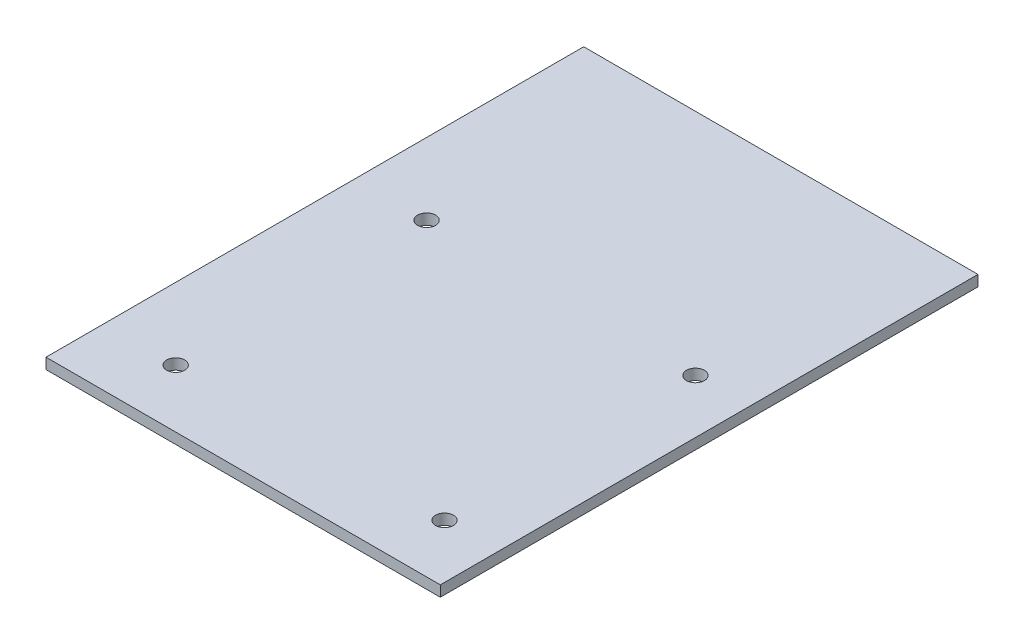
ISO-10303-21;
HEADER;
FILE_DESCRIPTION(('STEP AP214'),'2;1');
FILE_NAME('part.step','',(''),(''),'','','');
FILE_SCHEMA(('AUTOMOTIVE_DESIGN { 1 0 10303 214 1 1 1 1 }'));
ENDSEC;
DATA;
#1=APPLICATION_CONTEXT('core data for automotive mechanical design processes');
#2=APPLICATION_PROTOCOL_DEFINITION('international standard','automotive_design',2000,#1);
#3=PRODUCT_CONTEXT('',#1,'mechanical');
#4=PRODUCT('Part','Part','',(#3));
#5=PRODUCT_RELATED_PRODUCT_CATEGORY('part','',(#4));
#6=PRODUCT_DEFINITION_FORMATION('','',#4);
#7=PRODUCT_DEFINITION_CONTEXT('part definition',#1,'design');
#8=PRODUCT_DEFINITION('design','',#6,#7);
#9=PRODUCT_DEFINITION_SHAPE('','',#8);
#10=(LENGTH_UNIT() NAMED_UNIT(*) SI_UNIT(.MILLI.,.METRE.));
#11=(NAMED_UNIT(*) PLANE_ANGLE_UNIT() SI_UNIT($,.RADIAN.));
#12=(NAMED_UNIT(*) SI_UNIT($,.STERADIAN.) SOLID_ANGLE_UNIT());
#13=UNCERTAINTY_MEASURE_WITH_UNIT(LENGTH_MEASURE(1.E-05),#10,'distance_accuracy_value','');
#14=(GEOMETRIC_REPRESENTATION_CONTEXT(3) GLOBAL_UNCERTAINTY_ASSIGNED_CONTEXT((#13)) GLOBAL_UNIT_ASSIGNED_CONTEXT((#10,
#11,#12)) REPRESENTATION_CONTEXT('',''));
#15=CARTESIAN_POINT('',(0.,0.,0.));
#16=DIRECTION('',(0.,0.,1.));
#17=DIRECTION('',(1.,0.,0.));
#18=AXIS2_PLACEMENT_3D('',#15,#16,#17);
#19=CARTESIAN_POINT('',(-110.,6.,-150.));
#20=DIRECTION('',(1.,0.,0.));
#21=DIRECTION('',(0.,0.,-1.));
#22=AXIS2_PLACEMENT_3D('',#19,#20,#21);
#23=PLANE('',#22);
#24=DIRECTION('',(0.,0.,1.));
#25=VECTOR('',#24,1.);
#26=CARTESIAN_POINT('',(-110.,0.,-150.));
#27=LINE('',#26,#25);
#28=CARTESIAN_POINT('',(-110.,0.,-150.));
#29=VERTEX_POINT('',#28);
#30=CARTESIAN_POINT('',(-110.,0.,150.));
#31=VERTEX_POINT('',#30);
#32=EDGE_CURVE('E93',#29,#31,#27,.T.);
#33=ORIENTED_EDGE('',*,*,#32,.T.);
#34=DIRECTION('',(0.,-1.,0.));
#35=VECTOR('',#34,1.);
#36=CARTESIAN_POINT('',(-110.,6.,150.));
#37=LINE('',#36,#35);
#38=CARTESIAN_POINT('',(-110.,6.,150.));
#39=VERTEX_POINT('',#38);
#40=EDGE_CURVE('E11',#39,#31,#37,.T.);
#41=ORIENTED_EDGE('',*,*,#40,.F.);
#42=DIRECTION('',(0.,0.,1.));
#43=VECTOR('',#42,1.);
#44=CARTESIAN_POINT('',(-110.,6.,-150.));
#45=LINE('',#44,#43);
#46=CARTESIAN_POINT('',(-110.,6.,-150.));
#47=VERTEX_POINT('',#46);
#48=EDGE_CURVE('E81',#47,#39,#45,.T.);
#49=ORIENTED_EDGE('',*,*,#48,.F.);
#50=DIRECTION('',(0.,-1.,0.));
#51=VECTOR('',#50,1.);
#52=CARTESIAN_POINT('',(-110.,6.,-150.));
#53=LINE('',#52,#51);
#54=EDGE_CURVE('E89',#47,#29,#53,.T.);
#55=ORIENTED_EDGE('',*,*,#54,.T.);
#56=EDGE_LOOP('',(#33,#41,#49,#55));
#57=FACE_BOUND('',#56,.T.);
#58=ADVANCED_FACE('F30',(#57),#23,.F.);
#59=CARTESIAN_POINT('',(-110.,6.,150.));
#60=DIRECTION('',(0.,0.,-1.));
#61=DIRECTION('',(-1.,0.,0.));
#62=AXIS2_PLACEMENT_3D('',#59,#60,#61);
#63=PLANE('',#62);
#64=DIRECTION('',(1.,0.,0.));
#65=VECTOR('',#64,1.);
#66=CARTESIAN_POINT('',(-110.,0.,150.));
#67=LINE('',#66,#65);
#68=CARTESIAN_POINT('',(110.,0.,150.));
#69=VERTEX_POINT('',#68);
#70=EDGE_CURVE('E85',#31,#69,#67,.T.);
#71=ORIENTED_EDGE('',*,*,#70,.T.);
#72=DIRECTION('',(0.,-1.,0.));
#73=VECTOR('',#72,1.);
#74=CARTESIAN_POINT('',(110.,6.,150.));
#75=LINE('',#74,#73);
#76=CARTESIAN_POINT('',(110.,6.,150.));
#77=VERTEX_POINT('',#76);
#78=EDGE_CURVE('E38',#77,#69,#75,.T.);
#79=ORIENTED_EDGE('',*,*,#78,.F.);
#80=DIRECTION('',(1.,0.,0.));
#81=VECTOR('',#80,1.);
#82=CARTESIAN_POINT('',(-110.,6.,150.));
#83=LINE('',#82,#81);
#84=EDGE_CURVE('E76',#39,#77,#83,.T.);
#85=ORIENTED_EDGE('',*,*,#84,.F.);
#86=ORIENTED_EDGE('',*,*,#40,.T.);
#87=EDGE_LOOP('',(#71,#79,#85,#86));
#88=FACE_BOUND('',#87,.T.);
#89=ADVANCED_FACE('F84',(#88),#63,.F.);
#90=CARTESIAN_POINT('',(110.,6.,-150.));
#91=DIRECTION('',(-1.,0.,0.));
#92=DIRECTION('',(0.,0.,1.));
#93=AXIS2_PLACEMENT_3D('',#90,#91,#92);
#94=PLANE('',#93);
#95=DIRECTION('',(0.,0.,-1.));
#96=VECTOR('',#95,1.);
#97=CARTESIAN_POINT('',(110.,0.,-150.));
#98=LINE('',#97,#96);
#99=CARTESIAN_POINT('',(110.,0.,-150.));
#100=VERTEX_POINT('',#99);
#101=EDGE_CURVE('E63',#69,#100,#98,.T.);
#102=ORIENTED_EDGE('',*,*,#101,.T.);
#103=DIRECTION('',(0.,-1.,0.));
#104=VECTOR('',#103,1.);
#105=CARTESIAN_POINT('',(110.,6.,-150.));
#106=LINE('',#105,#104);
#107=CARTESIAN_POINT('',(110.,6.,-150.));
#108=VERTEX_POINT('',#107);
#109=EDGE_CURVE('E86',#108,#100,#106,.T.);
#110=ORIENTED_EDGE('',*,*,#109,.F.);
#111=DIRECTION('',(0.,0.,-1.));
#112=VECTOR('',#111,1.);
#113=CARTESIAN_POINT('',(110.,6.,-150.));
#114=LINE('',#113,#112);
#115=EDGE_CURVE('E79',#77,#108,#114,.T.);
#116=ORIENTED_EDGE('',*,*,#115,.F.);
#117=ORIENTED_EDGE('',*,*,#78,.T.);
#118=EDGE_LOOP('',(#102,#110,#116,#117));
#119=FACE_BOUND('',#118,.T.);
#120=ADVANCED_FACE('F87',(#119),#94,.F.);
#121=CARTESIAN_POINT('',(-110.,6.,-150.));
#122=DIRECTION('',(0.,0.,1.));
#123=DIRECTION('',(1.,0.,0.));
#124=AXIS2_PLACEMENT_3D('',#121,#122,#123);
#125=PLANE('',#124);
#126=DIRECTION('',(-1.,0.,0.));
#127=VECTOR('',#126,1.);
#128=CARTESIAN_POINT('',(-110.,0.,-150.));
#129=LINE('',#128,#127);
#130=EDGE_CURVE('E69',#100,#29,#129,.T.);
#131=ORIENTED_EDGE('',*,*,#130,.T.);
#132=ORIENTED_EDGE('',*,*,#54,.F.);
#133=DIRECTION('',(-1.,0.,0.));
#134=VECTOR('',#133,1.);
#135=CARTESIAN_POINT('',(-110.,6.,-150.));
#136=LINE('',#135,#134);
#137=EDGE_CURVE('E46',#108,#47,#136,.T.);
#138=ORIENTED_EDGE('',*,*,#137,.F.);
#139=ORIENTED_EDGE('',*,*,#109,.T.);
#140=EDGE_LOOP('',(#131,#132,#138,#139));
#141=FACE_BOUND('',#140,.T.);
#142=ADVANCED_FACE('F101',(#141),#125,.F.);
#143=CARTESIAN_POINT('',(-110.,6.,150.));
#144=DIRECTION('',(0.,1.,0.));
#145=DIRECTION('',(0.,0.,1.));
#146=AXIS2_PLACEMENT_3D('',#143,#144,#145);
#147=PLANE('',#146);
#148=CARTESIAN_POINT('',(-70.,6.,117.650973615517));
#149=DIRECTION('',(0.,1.,0.));
#150=DIRECTION('',(0.,0.,1.));
#151=AXIS2_PLACEMENT_3D('',#148,#149,#150);
#152=CIRCLE('',#151,5.);
#153=CARTESIAN_POINT('',(-70.,6.,122.650973615517));
#154=VERTEX_POINT('',#153);
#155=EDGE_CURVE('E124',#154,#154,#152,.T.);
#156=ORIENTED_EDGE('',*,*,#155,.F.);
#157=EDGE_LOOP('',(#156));
#158=FACE_BOUND('',#157,.T.);
#159=CARTESIAN_POINT('',(80.,6.,117.650973615517));
#160=DIRECTION('',(0.,1.,0.));
#161=DIRECTION('',(0.,0.,1.));
#162=AXIS2_PLACEMENT_3D('',#159,#160,#161);
#163=CIRCLE('',#162,5.);
#164=CARTESIAN_POINT('',(80.,6.,122.650973615517));
#165=VERTEX_POINT('',#164);
#166=EDGE_CURVE('E118',#165,#165,#163,.T.);
#167=ORIENTED_EDGE('',*,*,#166,.F.);
#168=EDGE_LOOP('',(#167));
#169=FACE_BOUND('',#168,.T.);
#170=CARTESIAN_POINT('',(79.9999999999999,6.,-22.3490263844827));
#171=DIRECTION('',(0.,1.,0.));
#172=DIRECTION('',(0.,0.,1.));
#173=AXIS2_PLACEMENT_3D('',#170,#171,#172);
#174=CIRCLE('',#173,5.);
#175=CARTESIAN_POINT('',(79.9999999999999,6.,-17.3490263844827));
#176=VERTEX_POINT('',#175);
#177=EDGE_CURVE('E112',#176,#176,#174,.T.);
#178=ORIENTED_EDGE('',*,*,#177,.F.);
#179=EDGE_LOOP('',(#178));
#180=FACE_BOUND('',#179,.T.);
#181=CARTESIAN_POINT('',(-70.0000000000001,6.,-22.3490263844827));
#182=DIRECTION('',(0.,1.,0.));
#183=DIRECTION('',(0.,0.,1.));
#184=AXIS2_PLACEMENT_3D('',#181,#182,#183);
#185=CIRCLE('',#184,5.);
#186=CARTESIAN_POINT('',(-70.0000000000001,6.,-17.3490263844827));
#187=VERTEX_POINT('',#186);
#188=EDGE_CURVE('E96',#187,#187,#185,.T.);
#189=ORIENTED_EDGE('',*,*,#188,.F.);
#190=EDGE_LOOP('',(#189));
#191=FACE_BOUND('',#190,.T.);
#192=ORIENTED_EDGE('',*,*,#48,.T.);
#193=ORIENTED_EDGE('',*,*,#84,.T.);
#194=ORIENTED_EDGE('',*,*,#115,.T.);
#195=ORIENTED_EDGE('',*,*,#137,.T.);
#196=EDGE_LOOP('',(#192,#193,#194,#195));
#197=FACE_BOUND('',#196,.T.);
#198=ADVANCED_FACE('F77',(#158,#169,#180,#191,#197),#147,.T.);
#199=CARTESIAN_POINT('',(-110.,0.,150.));
#200=DIRECTION('',(0.,1.,0.));
#201=DIRECTION('',(0.,0.,1.));
#202=AXIS2_PLACEMENT_3D('',#199,#200,#201);
#203=PLANE('',#202);
#204=CARTESIAN_POINT('',(-70.,0.,117.650973615517));
#205=DIRECTION('',(0.,-1.,0.));
#206=DIRECTION('',(0.,0.,-1.));
#207=AXIS2_PLACEMENT_3D('',#204,#205,#206);
#208=CIRCLE('',#207,5.);
#209=CARTESIAN_POINT('',(-70.,0.,112.650973615517));
#210=VERTEX_POINT('',#209);
#211=EDGE_CURVE('E127',#210,#210,#208,.T.);
#212=ORIENTED_EDGE('',*,*,#211,.F.);
#213=EDGE_LOOP('',(#212));
#214=FACE_BOUND('',#213,.T.);
#215=CARTESIAN_POINT('',(80.,0.,117.650973615517));
#216=DIRECTION('',(0.,-1.,0.));
#217=DIRECTION('',(0.,0.,-1.));
#218=AXIS2_PLACEMENT_3D('',#215,#216,#217);
#219=CIRCLE('',#218,5.);
#220=CARTESIAN_POINT('',(80.,0.,112.650973615517));
#221=VERTEX_POINT('',#220);
#222=EDGE_CURVE('E121',#221,#221,#219,.T.);
#223=ORIENTED_EDGE('',*,*,#222,.F.);
#224=EDGE_LOOP('',(#223));
#225=FACE_BOUND('',#224,.T.);
#226=CARTESIAN_POINT('',(79.9999999999999,0.,-22.3490263844827));
#227=DIRECTION('',(0.,-1.,0.));
#228=DIRECTION('',(0.,0.,-1.));
#229=AXIS2_PLACEMENT_3D('',#226,#227,#228);
#230=CIRCLE('',#229,5.);
#231=CARTESIAN_POINT('',(79.9999999999999,0.,-27.3490263844827));
#232=VERTEX_POINT('',#231);
#233=EDGE_CURVE('E115',#232,#232,#230,.T.);
#234=ORIENTED_EDGE('',*,*,#233,.F.);
#235=EDGE_LOOP('',(#234));
#236=FACE_BOUND('',#235,.T.);
#237=CARTESIAN_POINT('',(-70.0000000000001,0.,-22.3490263844827));
#238=DIRECTION('',(0.,-1.,0.));
#239=DIRECTION('',(0.,0.,-1.));
#240=AXIS2_PLACEMENT_3D('',#237,#238,#239);
#241=CIRCLE('',#240,5.);
#242=CARTESIAN_POINT('',(-70.0000000000001,0.,-27.3490263844827));
#243=VERTEX_POINT('',#242);
#244=EDGE_CURVE('E109',#243,#243,#241,.T.);
#245=ORIENTED_EDGE('',*,*,#244,.F.);
#246=EDGE_LOOP('',(#245));
#247=FACE_BOUND('',#246,.T.);
#248=ORIENTED_EDGE('',*,*,#32,.F.);
#249=ORIENTED_EDGE('',*,*,#130,.F.);
#250=ORIENTED_EDGE('',*,*,#101,.F.);
#251=ORIENTED_EDGE('',*,*,#70,.F.);
#252=EDGE_LOOP('',(#248,#249,#250,#251));
#253=FACE_BOUND('',#252,.T.);
#254=ADVANCED_FACE('F104',(#214,#225,#236,#247,#253),#203,.F.);
#255=CARTESIAN_POINT('',(-70.0000000000001,0.,-22.3490263844827));
#256=DIRECTION('',(0.,-1.,0.));
#257=DIRECTION('',(0.,0.,-1.));
#258=AXIS2_PLACEMENT_3D('',#255,#256,#257);
#259=CYLINDRICAL_SURFACE('',#258,5.);
#260=ORIENTED_EDGE('',*,*,#188,.T.);
#261=EDGE_LOOP('',(#260));
#262=FACE_BOUND('',#261,.T.);
#263=ORIENTED_EDGE('',*,*,#244,.T.);
#264=EDGE_LOOP('',(#263));
#265=FACE_BOUND('',#264,.T.);
#266=ADVANCED_FACE('F135',(#262,#265),#259,.F.);
#267=CARTESIAN_POINT('',(79.9999999999999,0.,-22.3490263844827));
#268=DIRECTION('',(0.,-1.,0.));
#269=DIRECTION('',(0.,0.,-1.));
#270=AXIS2_PLACEMENT_3D('',#267,#268,#269);
#271=CYLINDRICAL_SURFACE('',#270,5.);
#272=ORIENTED_EDGE('',*,*,#177,.T.);
#273=EDGE_LOOP('',(#272));
#274=FACE_BOUND('',#273,.T.);
#275=ORIENTED_EDGE('',*,*,#233,.T.);
#276=EDGE_LOOP('',(#275));
#277=FACE_BOUND('',#276,.T.);
#278=ADVANCED_FACE('F144',(#274,#277),#271,.F.);
#279=CARTESIAN_POINT('',(80.,0.,117.650973615517));
#280=DIRECTION('',(0.,-1.,0.));
#281=DIRECTION('',(0.,0.,-1.));
#282=AXIS2_PLACEMENT_3D('',#279,#280,#281);
#283=CYLINDRICAL_SURFACE('',#282,5.);
#284=ORIENTED_EDGE('',*,*,#166,.T.);
#285=EDGE_LOOP('',(#284));
#286=FACE_BOUND('',#285,.T.);
#287=ORIENTED_EDGE('',*,*,#222,.T.);
#288=EDGE_LOOP('',(#287));
#289=FACE_BOUND('',#288,.T.);
#290=ADVANCED_FACE('F150',(#286,#289),#283,.F.);
#291=CARTESIAN_POINT('',(-70.,0.,117.650973615517));
#292=DIRECTION('',(0.,-1.,0.));
#293=DIRECTION('',(0.,0.,-1.));
#294=AXIS2_PLACEMENT_3D('',#291,#292,#293);
#295=CYLINDRICAL_SURFACE('',#294,5.);
#296=ORIENTED_EDGE('',*,*,#155,.T.);
#297=EDGE_LOOP('',(#296));
#298=FACE_BOUND('',#297,.T.);
#299=ORIENTED_EDGE('',*,*,#211,.T.);
#300=EDGE_LOOP('',(#299));
#301=FACE_BOUND('',#300,.T.);
#302=ADVANCED_FACE('F131',(#298,#301),#295,.F.);
#303=CLOSED_SHELL('',(#58,#89,#120,#142,#198,#254,#266,#278,#290,#302));
#304=MANIFOLD_SOLID_BREP('B2',#303);
#305=ADVANCED_BREP_SHAPE_REPRESENTATION('',(#18,#304),#14);
#306=SHAPE_DEFINITION_REPRESENTATION(#9,#305);
ENDSEC;
END-ISO-10303-21;
